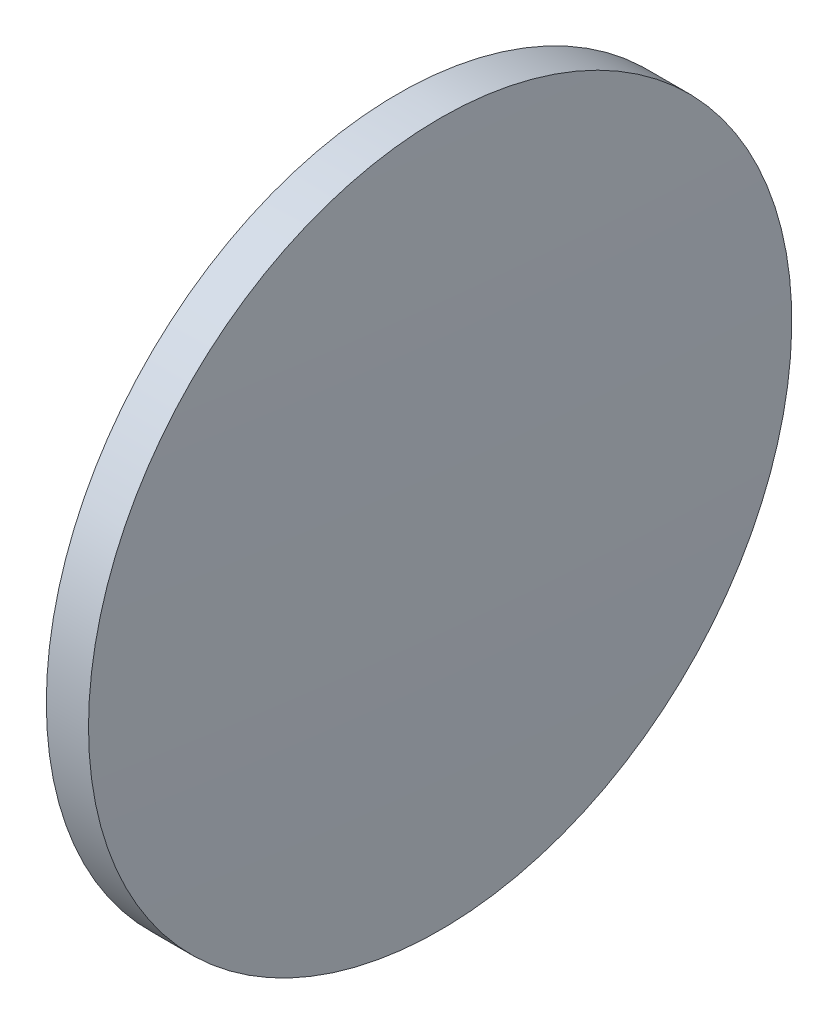
ISO-10303-21;
HEADER;
FILE_DESCRIPTION(('STEP AP214'),'2;1');
FILE_NAME('part.step','',(''),(''),'','','');
FILE_SCHEMA(('AUTOMOTIVE_DESIGN { 1 0 10303 214 1 1 1 1 }'));
ENDSEC;
DATA;
#1=APPLICATION_CONTEXT('core data for automotive mechanical design processes');
#2=APPLICATION_PROTOCOL_DEFINITION('international standard','automotive_design',2000,#1);
#3=PRODUCT_CONTEXT('',#1,'mechanical');
#4=PRODUCT('Part','Part','',(#3));
#5=PRODUCT_RELATED_PRODUCT_CATEGORY('part','',(#4));
#6=PRODUCT_DEFINITION_FORMATION('','',#4);
#7=PRODUCT_DEFINITION_CONTEXT('part definition',#1,'design');
#8=PRODUCT_DEFINITION('design','',#6,#7);
#9=PRODUCT_DEFINITION_SHAPE('','',#8);
#10=(LENGTH_UNIT() NAMED_UNIT(*) SI_UNIT(.MILLI.,.METRE.));
#11=(NAMED_UNIT(*) PLANE_ANGLE_UNIT() SI_UNIT($,.RADIAN.));
#12=(NAMED_UNIT(*) SI_UNIT($,.STERADIAN.) SOLID_ANGLE_UNIT());
#13=UNCERTAINTY_MEASURE_WITH_UNIT(LENGTH_MEASURE(1.E-05),#10,'distance_accuracy_value','');
#14=(GEOMETRIC_REPRESENTATION_CONTEXT(3) GLOBAL_UNCERTAINTY_ASSIGNED_CONTEXT((#13)) GLOBAL_UNIT_ASSIGNED_CONTEXT((#10,
#11,#12)) REPRESENTATION_CONTEXT('',''));
#15=CARTESIAN_POINT('',(0.,0.,0.));
#16=DIRECTION('',(0.,0.,1.));
#17=DIRECTION('',(1.,0.,0.));
#18=AXIS2_PLACEMENT_3D('',#15,#16,#17);
#19=CARTESIAN_POINT('',(19.8693879828842,126.282739099667,0.));
#20=DIRECTION('',(-1.,0.,0.));
#21=DIRECTION('',(0.,1.,0.));
#22=AXIS2_PLACEMENT_3D('',#19,#20,#21);
#23=SPHERICAL_SURFACE('',#22,390.725000000002);
#24=CARTESIAN_POINT('',(410.394387982886,126.282739099667,0.));
#25=DIRECTION('',(-1.,0.,0.));
#26=DIRECTION('',(0.,0.,1.));
#27=AXIS2_PLACEMENT_3D('',#24,#25,#26);
#28=CIRCLE('',#27,12.5);
#29=CARTESIAN_POINT('',(410.394387982886,126.282739099667,12.5));
#30=VERTEX_POINT('',#29);
#31=EDGE_CURVE('E10',#30,#30,#28,.T.);
#32=ORIENTED_EDGE('',*,*,#31,.F.);
#33=EDGE_LOOP('',(#32));
#34=FACE_BOUND('',#33,.T.);
#35=ADVANCED_FACE('F35',(#34),#23,.T.);
#36=CARTESIAN_POINT('',(404.152356740996,126.282739099667,0.));
#37=DIRECTION('',(-1.,0.,0.));
#38=DIRECTION('',(0.,0.,1.));
#39=AXIS2_PLACEMENT_3D('',#36,#37,#38);
#40=CYLINDRICAL_SURFACE('',#39,12.5);
#41=CARTESIAN_POINT('',(408.894387982886,126.282739099667,0.));
#42=DIRECTION('',(-1.,0.,0.));
#43=DIRECTION('',(0.,0.,1.));
#44=AXIS2_PLACEMENT_3D('',#41,#42,#43);
#45=CIRCLE('',#44,12.5);
#46=CARTESIAN_POINT('',(408.894387982886,126.282739099667,12.5));
#47=VERTEX_POINT('',#46);
#48=EDGE_CURVE('E41',#47,#47,#45,.T.);
#49=ORIENTED_EDGE('',*,*,#48,.F.);
#50=EDGE_LOOP('',(#49));
#51=FACE_BOUND('',#50,.T.);
#52=ORIENTED_EDGE('',*,*,#31,.T.);
#53=EDGE_LOOP('',(#52));
#54=FACE_BOUND('',#53,.T.);
#55=ADVANCED_FACE('F49',(#51,#54),#40,.T.);
#56=CARTESIAN_POINT('',(408.894387982886,126.282739099667,0.));
#57=DIRECTION('',(1.,0.,0.));
#58=DIRECTION('',(0.,0.,-1.));
#59=AXIS2_PLACEMENT_3D('',#56,#57,#58);
#60=PLANE('',#59);
#61=ORIENTED_EDGE('',*,*,#48,.T.);
#62=EDGE_LOOP('',(#61));
#63=FACE_BOUND('',#62,.T.);
#64=ADVANCED_FACE('F47',(#63),#60,.F.);
#65=CLOSED_SHELL('',(#35,#55,#64));
#66=MANIFOLD_SOLID_BREP('B2',#65);
#67=ADVANCED_BREP_SHAPE_REPRESENTATION('',(#18,#66),#14);
#68=SHAPE_DEFINITION_REPRESENTATION(#9,#67);
ENDSEC;
END-ISO-10303-21;
